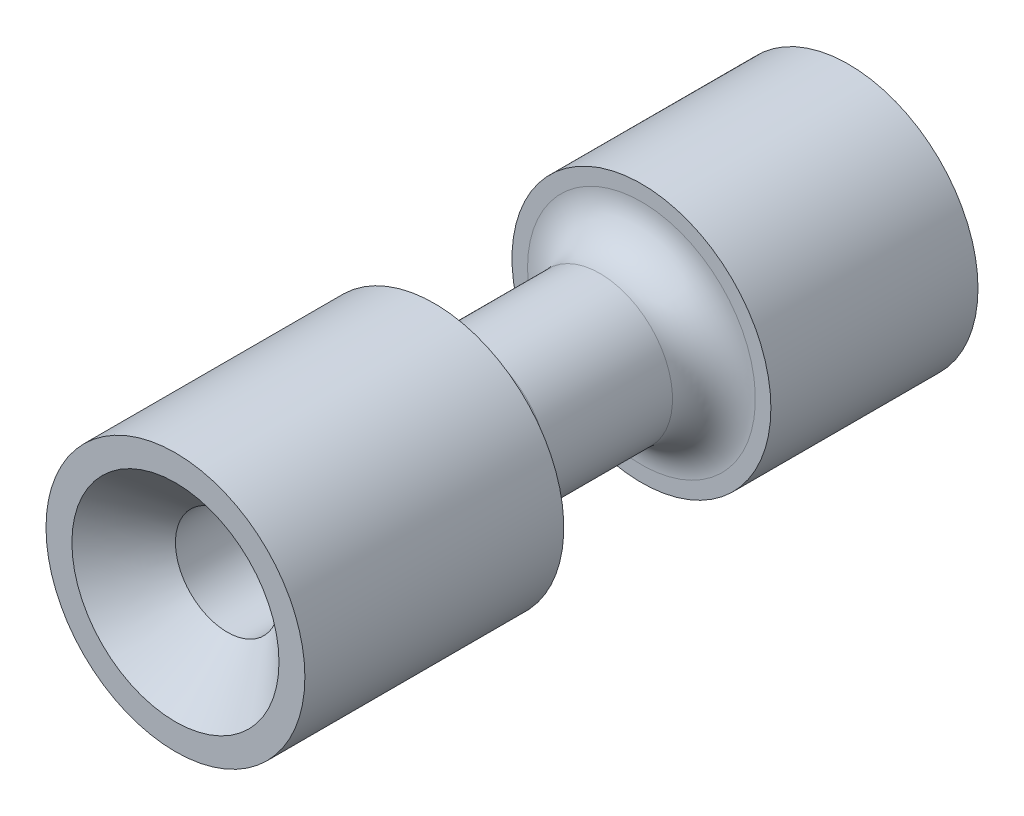
ISO-10303-21;
HEADER;
FILE_DESCRIPTION(('STEP AP214'),'2;1');
FILE_NAME('part.step','',(''),(''),'','','');
FILE_SCHEMA(('AUTOMOTIVE_DESIGN { 1 0 10303 214 1 1 1 1 }'));
ENDSEC;
DATA;
#1=APPLICATION_CONTEXT('core data for automotive mechanical design processes');
#2=APPLICATION_PROTOCOL_DEFINITION('international standard','automotive_design',2000,#1);
#3=PRODUCT_CONTEXT('',#1,'mechanical');
#4=PRODUCT('Part','Part','',(#3));
#5=PRODUCT_RELATED_PRODUCT_CATEGORY('part','',(#4));
#6=PRODUCT_DEFINITION_FORMATION('','',#4);
#7=PRODUCT_DEFINITION_CONTEXT('part definition',#1,'design');
#8=PRODUCT_DEFINITION('design','',#6,#7);
#9=PRODUCT_DEFINITION_SHAPE('','',#8);
#10=(LENGTH_UNIT() NAMED_UNIT(*) SI_UNIT(.MILLI.,.METRE.));
#11=(NAMED_UNIT(*) PLANE_ANGLE_UNIT() SI_UNIT($,.RADIAN.));
#12=(NAMED_UNIT(*) SI_UNIT($,.STERADIAN.) SOLID_ANGLE_UNIT());
#13=UNCERTAINTY_MEASURE_WITH_UNIT(LENGTH_MEASURE(1.E-05),#10,'distance_accuracy_value','');
#14=(GEOMETRIC_REPRESENTATION_CONTEXT(3) GLOBAL_UNCERTAINTY_ASSIGNED_CONTEXT((#13)) GLOBAL_UNIT_ASSIGNED_CONTEXT((#10,
#11,#12)) REPRESENTATION_CONTEXT('',''));
#15=CARTESIAN_POINT('',(0.,0.,0.));
#16=DIRECTION('',(0.,0.,1.));
#17=DIRECTION('',(1.,0.,0.));
#18=AXIS2_PLACEMENT_3D('',#15,#16,#17);
#19=CARTESIAN_POINT('',(0.,0.,13.));
#20=DIRECTION('',(0.,0.,-1.));
#21=DIRECTION('',(-1.,0.,0.));
#22=AXIS2_PLACEMENT_3D('',#19,#20,#21);
#23=CYLINDRICAL_SURFACE('',#22,2.5);
#24=CARTESIAN_POINT('',(0.,0.,0.));
#25=DIRECTION('',(0.,0.,1.));
#26=DIRECTION('',(1.,0.,0.));
#27=AXIS2_PLACEMENT_3D('',#24,#25,#26);
#28=CIRCLE('',#27,2.5);
#29=CARTESIAN_POINT('',(2.5,0.,0.));
#30=VERTEX_POINT('',#29);
#31=EDGE_CURVE('E43',#30,#30,#28,.T.);
#32=ORIENTED_EDGE('',*,*,#31,.T.);
#33=EDGE_LOOP('',(#32));
#34=FACE_BOUND('',#33,.T.);
#35=CARTESIAN_POINT('',(0.,0.,4.));
#36=DIRECTION('',(0.,0.,1.));
#37=DIRECTION('',(1.,0.,0.));
#38=AXIS2_PLACEMENT_3D('',#35,#36,#37);
#39=CIRCLE('',#38,2.5);
#40=CARTESIAN_POINT('',(2.5,0.,4.));
#41=VERTEX_POINT('',#40);
#42=EDGE_CURVE('E46',#41,#41,#39,.T.);
#43=ORIENTED_EDGE('',*,*,#42,.F.);
#44=EDGE_LOOP('',(#43));
#45=FACE_BOUND('',#44,.T.);
#46=ADVANCED_FACE('F28',(#34,#45),#23,.T.);
#47=CARTESIAN_POINT('',(0.,0.,0.));
#48=DIRECTION('',(0.,0.,1.));
#49=DIRECTION('',(1.,0.,0.));
#50=AXIS2_PLACEMENT_3D('',#47,#48,#49);
#51=PLANE('',#50);
#52=CARTESIAN_POINT('',(0.,0.,0.));
#53=DIRECTION('',(0.,0.,1.));
#54=DIRECTION('',(1.,0.,0.));
#55=AXIS2_PLACEMENT_3D('',#52,#53,#54);
#56=CIRCLE('',#55,0.999999999999997);
#57=CARTESIAN_POINT('',(0.999999999999997,0.,0.));
#58=VERTEX_POINT('',#57);
#59=EDGE_CURVE('E66',#58,#58,#56,.T.);
#60=ORIENTED_EDGE('',*,*,#59,.T.);
#61=EDGE_LOOP('',(#60));
#62=FACE_BOUND('',#61,.T.);
#63=ORIENTED_EDGE('',*,*,#31,.F.);
#64=EDGE_LOOP('',(#63));
#65=FACE_BOUND('',#64,.T.);
#66=ADVANCED_FACE('F70',(#62,#65),#51,.F.);
#67=CARTESIAN_POINT('',(3.13823026620804,0.,4.));
#68=DIRECTION('',(0.,0.,1.));
#69=DIRECTION('',(1.,0.,0.));
#70=AXIS2_PLACEMENT_3D('',#67,#68,#69);
#71=PLANE('',#70);
#72=CARTESIAN_POINT('',(0.,0.,4.));
#73=DIRECTION('',(0.,0.,-1.));
#74=DIRECTION('',(-1.,0.,0.));
#75=AXIS2_PLACEMENT_3D('',#72,#73,#74);
#76=CIRCLE('',#75,2.2);
#77=CARTESIAN_POINT('',(-2.2,0.,4.));
#78=VERTEX_POINT('',#77);
#79=EDGE_CURVE('E52',#78,#78,#76,.T.);
#80=ORIENTED_EDGE('',*,*,#79,.T.);
#81=EDGE_LOOP('',(#80));
#82=FACE_BOUND('',#81,.T.);
#83=ORIENTED_EDGE('',*,*,#42,.T.);
#84=EDGE_LOOP('',(#83));
#85=FACE_BOUND('',#84,.T.);
#86=ADVANCED_FACE('F90',(#82,#85),#71,.T.);
#87=CARTESIAN_POINT('',(3.13823026620804,0.,8.));
#88=DIRECTION('',(0.,0.,-1.));
#89=DIRECTION('',(-1.,0.,0.));
#90=AXIS2_PLACEMENT_3D('',#87,#88,#89);
#91=PLANE('',#90);
#92=CARTESIAN_POINT('',(0.,0.,8.));
#93=DIRECTION('',(0.,0.,-1.));
#94=DIRECTION('',(-1.,0.,0.));
#95=AXIS2_PLACEMENT_3D('',#92,#93,#94);
#96=CIRCLE('',#95,2.2);
#97=CARTESIAN_POINT('',(-2.2,0.,8.));
#98=VERTEX_POINT('',#97);
#99=EDGE_CURVE('E63',#98,#98,#96,.T.);
#100=ORIENTED_EDGE('',*,*,#99,.F.);
#101=EDGE_LOOP('',(#100));
#102=FACE_BOUND('',#101,.T.);
#103=CARTESIAN_POINT('',(0.,0.,8.));
#104=DIRECTION('',(0.,0.,-1.));
#105=DIRECTION('',(-1.,0.,0.));
#106=AXIS2_PLACEMENT_3D('',#103,#104,#105);
#107=CIRCLE('',#106,2.5);
#108=CARTESIAN_POINT('',(-2.5,0.,8.));
#109=VERTEX_POINT('',#108);
#110=EDGE_CURVE('E49',#109,#109,#107,.T.);
#111=ORIENTED_EDGE('',*,*,#110,.T.);
#112=EDGE_LOOP('',(#111));
#113=FACE_BOUND('',#112,.T.);
#114=ADVANCED_FACE('F99',(#102,#113),#91,.T.);
#115=CARTESIAN_POINT('',(0.,0.,4.8));
#116=DIRECTION('',(0.,0.,-1.));
#117=DIRECTION('',(-1.,0.,0.));
#118=AXIS2_PLACEMENT_3D('',#115,#116,#117);
#119=TOROIDAL_SURFACE('',#118,2.2,0.8);
#120=CARTESIAN_POINT('',(0.,0.,4.8));
#121=DIRECTION('',(0.,0.,-1.));
#122=DIRECTION('',(-1.,0.,0.));
#123=AXIS2_PLACEMENT_3D('',#120,#121,#122);
#124=CIRCLE('',#123,1.4);
#125=CARTESIAN_POINT('',(-1.4,0.,4.8));
#126=VERTEX_POINT('',#125);
#127=EDGE_CURVE('E57',#126,#126,#124,.T.);
#128=ORIENTED_EDGE('',*,*,#127,.T.);
#129=EDGE_LOOP('',(#128));
#130=FACE_BOUND('',#129,.T.);
#131=ORIENTED_EDGE('',*,*,#79,.F.);
#132=EDGE_LOOP('',(#131));
#133=FACE_BOUND('',#132,.T.);
#134=ADVANCED_FACE('F101',(#130,#133),#119,.F.);
#135=CARTESIAN_POINT('',(0.,0.,0.));
#136=DIRECTION('',(0.,0.,-1.));
#137=DIRECTION('',(-1.,0.,0.));
#138=AXIS2_PLACEMENT_3D('',#135,#136,#137);
#139=CYLINDRICAL_SURFACE('',#138,1.4);
#140=CARTESIAN_POINT('',(0.,0.,7.2));
#141=DIRECTION('',(0.,0.,-1.));
#142=DIRECTION('',(-1.,0.,0.));
#143=AXIS2_PLACEMENT_3D('',#140,#141,#142);
#144=CIRCLE('',#143,1.4);
#145=CARTESIAN_POINT('',(-1.4,0.,7.2));
#146=VERTEX_POINT('',#145);
#147=EDGE_CURVE('E60',#146,#146,#144,.T.);
#148=ORIENTED_EDGE('',*,*,#147,.T.);
#149=EDGE_LOOP('',(#148));
#150=FACE_BOUND('',#149,.T.);
#151=ORIENTED_EDGE('',*,*,#127,.F.);
#152=EDGE_LOOP('',(#151));
#153=FACE_BOUND('',#152,.T.);
#154=ADVANCED_FACE('F104',(#150,#153),#139,.T.);
#155=CARTESIAN_POINT('',(0.,0.,7.2));
#156=DIRECTION('',(0.,0.,-1.));
#157=DIRECTION('',(-1.,0.,0.));
#158=AXIS2_PLACEMENT_3D('',#155,#156,#157);
#159=TOROIDAL_SURFACE('',#158,2.2,0.8);
#160=ORIENTED_EDGE('',*,*,#99,.T.);
#161=EDGE_LOOP('',(#160));
#162=FACE_BOUND('',#161,.T.);
#163=ORIENTED_EDGE('',*,*,#147,.F.);
#164=EDGE_LOOP('',(#163));
#165=FACE_BOUND('',#164,.T.);
#166=ADVANCED_FACE('F96',(#162,#165),#159,.F.);
#167=CARTESIAN_POINT('',(0.,0.,13.));
#168=DIRECTION('',(0.,0.,1.));
#169=DIRECTION('',(1.,0.,0.));
#170=AXIS2_PLACEMENT_3D('',#167,#168,#169);
#171=PLANE('',#170);
#172=CARTESIAN_POINT('',(0.,0.,13.));
#173=DIRECTION('',(0.,0.,1.));
#174=DIRECTION('',(1.,0.,0.));
#175=AXIS2_PLACEMENT_3D('',#172,#173,#174);
#176=CIRCLE('',#175,1.99999999999998);
#177=CARTESIAN_POINT('',(1.99999999999998,0.,13.));
#178=VERTEX_POINT('',#177);
#179=EDGE_CURVE('E10',#178,#178,#176,.F.);
#180=ORIENTED_EDGE('',*,*,#179,.T.);
#181=EDGE_LOOP('',(#180));
#182=FACE_BOUND('',#181,.T.);
#183=CARTESIAN_POINT('',(0.,0.,13.));
#184=DIRECTION('',(0.,0.,1.));
#185=DIRECTION('',(1.,0.,0.));
#186=AXIS2_PLACEMENT_3D('',#183,#184,#185);
#187=CIRCLE('',#186,2.5);
#188=CARTESIAN_POINT('',(2.5,0.,13.));
#189=VERTEX_POINT('',#188);
#190=EDGE_CURVE('E39',#189,#189,#187,.T.);
#191=ORIENTED_EDGE('',*,*,#190,.T.);
#192=EDGE_LOOP('',(#191));
#193=FACE_BOUND('',#192,.T.);
#194=ADVANCED_FACE('F82',(#182,#193),#171,.T.);
#195=ORIENTED_EDGE('',*,*,#190,.F.);
#196=EDGE_LOOP('',(#195));
#197=FACE_BOUND('',#196,.T.);
#198=ORIENTED_EDGE('',*,*,#110,.F.);
#199=EDGE_LOOP('',(#198));
#200=FACE_BOUND('',#199,.T.);
#201=ADVANCED_FACE('F75',(#197,#200),#23,.T.);
#202=CARTESIAN_POINT('',(0.,0.,13.));
#203=DIRECTION('',(0.,0.,1.));
#204=DIRECTION('',(1.,0.,0.));
#205=AXIS2_PLACEMENT_3D('',#202,#203,#204);
#206=CYLINDRICAL_SURFACE('',#205,0.999999999999992);
#207=CARTESIAN_POINT('',(0.,0.,12.));
#208=DIRECTION('',(0.,0.,1.));
#209=DIRECTION('',(1.,0.,0.));
#210=AXIS2_PLACEMENT_3D('',#207,#208,#209);
#211=CIRCLE('',#210,0.999999999999992);
#212=CARTESIAN_POINT('',(0.999999999999992,0.,12.));
#213=VERTEX_POINT('',#212);
#214=EDGE_CURVE('E35',#213,#213,#211,.T.);
#215=ORIENTED_EDGE('',*,*,#214,.T.);
#216=EDGE_LOOP('',(#215));
#217=FACE_BOUND('',#216,.T.);
#218=ORIENTED_EDGE('',*,*,#59,.F.);
#219=EDGE_LOOP('',(#218));
#220=FACE_BOUND('',#219,.T.);
#221=ADVANCED_FACE('F73',(#217,#220),#206,.F.);
#222=CARTESIAN_POINT('',(0.,0.,12.));
#223=DIRECTION('',(0.,0.,1.));
#224=DIRECTION('',(1.,0.,0.));
#225=AXIS2_PLACEMENT_3D('',#222,#223,#224);
#226=CONICAL_SURFACE('',#225,0.999999999999992,0.785398163397449);
#227=ORIENTED_EDGE('',*,*,#179,.F.);
#228=EDGE_LOOP('',(#227));
#229=FACE_BOUND('',#228,.T.);
#230=ORIENTED_EDGE('',*,*,#214,.F.);
#231=EDGE_LOOP('',(#230));
#232=FACE_BOUND('',#231,.T.);
#233=ADVANCED_FACE('F30',(#229,#232),#226,.F.);
#234=CLOSED_SHELL('',(#46,#66,#86,#114,#134,#154,#166,#194,#201,#221,#233));
#235=MANIFOLD_SOLID_BREP('B2',#234);
#236=ADVANCED_BREP_SHAPE_REPRESENTATION('',(#18,#235),#14);
#237=SHAPE_DEFINITION_REPRESENTATION(#9,#236);
ENDSEC;
END-ISO-10303-21;
